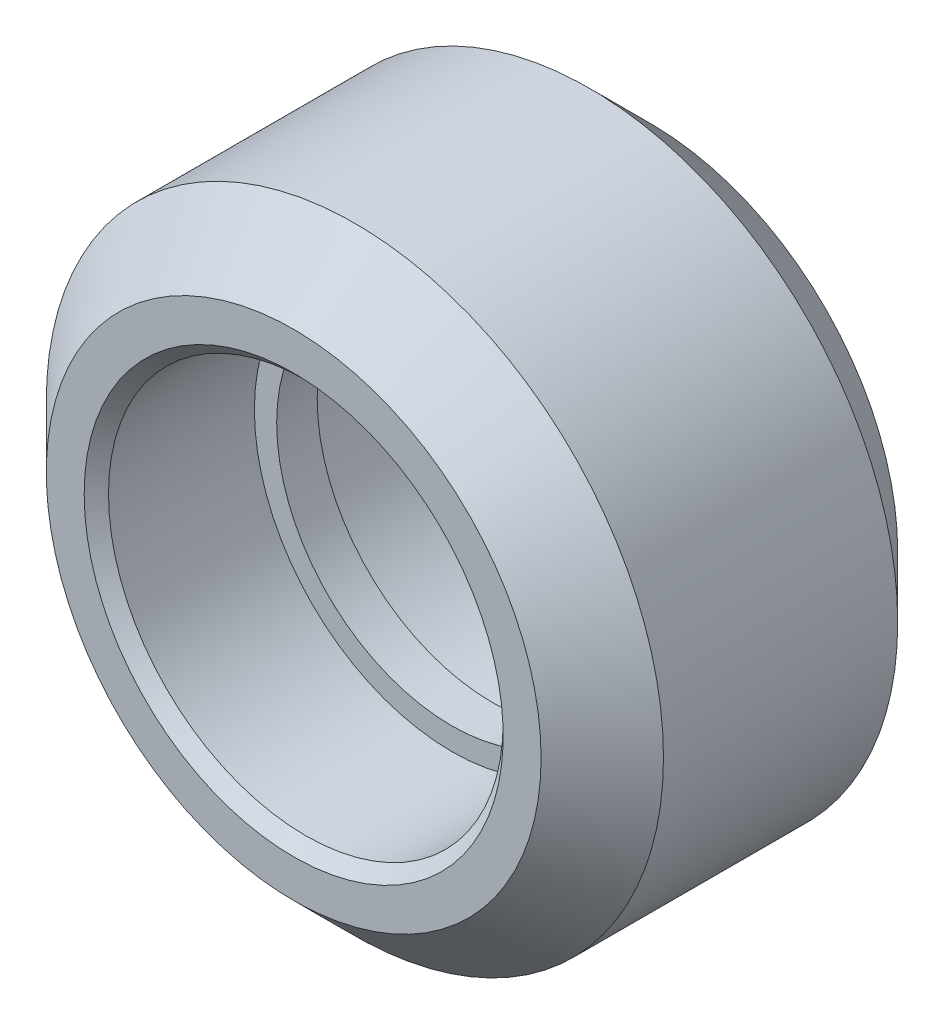
ISO-10303-21;
HEADER;
FILE_DESCRIPTION(('STEP AP214'),'2;1');
FILE_NAME('part.step','',(''),(''),'','','');
FILE_SCHEMA(('AUTOMOTIVE_DESIGN { 1 0 10303 214 1 1 1 1 }'));
ENDSEC;
DATA;
#1=APPLICATION_CONTEXT('core data for automotive mechanical design processes');
#2=APPLICATION_PROTOCOL_DEFINITION('international standard','automotive_design',2000,#1);
#3=PRODUCT_CONTEXT('',#1,'mechanical');
#4=PRODUCT('Part','Part','',(#3));
#5=PRODUCT_RELATED_PRODUCT_CATEGORY('part','',(#4));
#6=PRODUCT_DEFINITION_FORMATION('','',#4);
#7=PRODUCT_DEFINITION_CONTEXT('part definition',#1,'design');
#8=PRODUCT_DEFINITION('design','',#6,#7);
#9=PRODUCT_DEFINITION_SHAPE('','',#8);
#10=(LENGTH_UNIT() NAMED_UNIT(*) SI_UNIT(.MILLI.,.METRE.));
#11=(NAMED_UNIT(*) PLANE_ANGLE_UNIT() SI_UNIT($,.RADIAN.));
#12=(NAMED_UNIT(*) SI_UNIT($,.STERADIAN.) SOLID_ANGLE_UNIT());
#13=UNCERTAINTY_MEASURE_WITH_UNIT(LENGTH_MEASURE(1.E-05),#10,'distance_accuracy_value','');
#14=(GEOMETRIC_REPRESENTATION_CONTEXT(3) GLOBAL_UNCERTAINTY_ASSIGNED_CONTEXT((#13)) GLOBAL_UNIT_ASSIGNED_CONTEXT((#10,
#11,#12)) REPRESENTATION_CONTEXT('',''));
#15=CARTESIAN_POINT('',(0.,0.,0.));
#16=DIRECTION('',(0.,0.,1.));
#17=DIRECTION('',(1.,0.,0.));
#18=AXIS2_PLACEMENT_3D('',#15,#16,#17);
#19=CARTESIAN_POINT('',(0.,0.,0.));
#20=DIRECTION('',(0.,0.,1.));
#21=DIRECTION('',(1.,0.,0.));
#22=AXIS2_PLACEMENT_3D('',#19,#20,#21);
#23=CYLINDRICAL_SURFACE('',#22,7.615);
#24=CARTESIAN_POINT('',(0.,0.,2.89));
#25=DIRECTION('',(0.,0.,1.));
#26=DIRECTION('',(1.,0.,0.));
#27=AXIS2_PLACEMENT_3D('',#24,#25,#26);
#28=CIRCLE('',#27,7.615);
#29=CARTESIAN_POINT('',(7.615,0.,2.89));
#30=VERTEX_POINT('',#29);
#31=EDGE_CURVE('E50',#30,#30,#28,.T.);
#32=ORIENTED_EDGE('',*,*,#31,.F.);
#33=EDGE_LOOP('',(#32));
#34=FACE_BOUND('',#33,.T.);
#35=CARTESIAN_POINT('',(0.,0.,-2.89));
#36=DIRECTION('',(0.,0.,1.));
#37=DIRECTION('',(1.,0.,0.));
#38=AXIS2_PLACEMENT_3D('',#35,#36,#37);
#39=CIRCLE('',#38,7.615);
#40=CARTESIAN_POINT('',(7.615,0.,-2.89));
#41=VERTEX_POINT('',#40);
#42=EDGE_CURVE('E71',#41,#41,#39,.T.);
#43=ORIENTED_EDGE('',*,*,#42,.T.);
#44=EDGE_LOOP('',(#43));
#45=FACE_BOUND('',#44,.T.);
#46=ADVANCED_FACE('F30',(#34,#45),#23,.T.);
#47=CARTESIAN_POINT('',(0.,0.,2.89));
#48=DIRECTION('',(0.,0.,-1.));
#49=DIRECTION('',(-1.,0.,0.));
#50=AXIS2_PLACEMENT_3D('',#47,#48,#49);
#51=CONICAL_SURFACE('',#50,7.615,0.785398163397449);
#52=CARTESIAN_POINT('',(0.,0.,4.4));
#53=DIRECTION('',(0.,0.,1.));
#54=DIRECTION('',(1.,0.,0.));
#55=AXIS2_PLACEMENT_3D('',#52,#53,#54);
#56=CIRCLE('',#55,6.105);
#57=CARTESIAN_POINT('',(6.105,0.,4.4));
#58=VERTEX_POINT('',#57);
#59=EDGE_CURVE('E53',#58,#58,#56,.T.);
#60=ORIENTED_EDGE('',*,*,#59,.F.);
#61=EDGE_LOOP('',(#60));
#62=FACE_BOUND('',#61,.T.);
#63=ORIENTED_EDGE('',*,*,#31,.T.);
#64=EDGE_LOOP('',(#63));
#65=FACE_BOUND('',#64,.T.);
#66=ADVANCED_FACE('F95',(#62,#65),#51,.T.);
#67=CARTESIAN_POINT('',(0.,4.87,4.4));
#68=DIRECTION('',(0.,0.,-1.));
#69=DIRECTION('',(-1.,0.,0.));
#70=AXIS2_PLACEMENT_3D('',#67,#68,#69);
#71=PLANE('',#70);
#72=CARTESIAN_POINT('',(0.,0.,4.4));
#73=DIRECTION('',(0.,0.,-1.));
#74=DIRECTION('',(-1.,0.,0.));
#75=AXIS2_PLACEMENT_3D('',#72,#73,#74);
#76=CIRCLE('',#75,5.17);
#77=CARTESIAN_POINT('',(-5.17,0.,4.4));
#78=VERTEX_POINT('',#77);
#79=EDGE_CURVE('E10',#78,#78,#76,.T.);
#80=ORIENTED_EDGE('',*,*,#79,.T.);
#81=EDGE_LOOP('',(#80));
#82=FACE_BOUND('',#81,.T.);
#83=ORIENTED_EDGE('',*,*,#59,.T.);
#84=EDGE_LOOP('',(#83));
#85=FACE_BOUND('',#84,.T.);
#86=ADVANCED_FACE('F101',(#82,#85),#71,.F.);
#87=CARTESIAN_POINT('',(0.,0.,0.));
#88=DIRECTION('',(0.,0.,1.));
#89=DIRECTION('',(1.,0.,0.));
#90=AXIS2_PLACEMENT_3D('',#87,#88,#89);
#91=CYLINDRICAL_SURFACE('',#90,4.87);
#92=CARTESIAN_POINT('',(0.,0.,4.1));
#93=DIRECTION('',(0.,0.,-1.));
#94=DIRECTION('',(-1.,0.,0.));
#95=AXIS2_PLACEMENT_3D('',#92,#93,#94);
#96=CIRCLE('',#95,4.87);
#97=CARTESIAN_POINT('',(-4.87,0.,4.1));
#98=VERTEX_POINT('',#97);
#99=EDGE_CURVE('E37',#98,#98,#96,.F.);
#100=ORIENTED_EDGE('',*,*,#99,.T.);
#101=EDGE_LOOP('',(#100));
#102=FACE_BOUND('',#101,.T.);
#103=CARTESIAN_POINT('',(0.,0.,0.5));
#104=DIRECTION('',(0.,0.,1.));
#105=DIRECTION('',(1.,0.,0.));
#106=AXIS2_PLACEMENT_3D('',#103,#104,#105);
#107=CIRCLE('',#106,4.87);
#108=CARTESIAN_POINT('',(4.87,0.,0.5));
#109=VERTEX_POINT('',#108);
#110=EDGE_CURVE('E56',#109,#109,#107,.T.);
#111=ORIENTED_EDGE('',*,*,#110,.F.);
#112=EDGE_LOOP('',(#111));
#113=FACE_BOUND('',#112,.T.);
#114=ADVANCED_FACE('F132',(#102,#113),#91,.F.);
#115=CARTESIAN_POINT('',(0.,4.32,0.5));
#116=DIRECTION('',(0.,0.,-1.));
#117=DIRECTION('',(-1.,0.,0.));
#118=AXIS2_PLACEMENT_3D('',#115,#116,#117);
#119=PLANE('',#118);
#120=CARTESIAN_POINT('',(0.,0.,0.5));
#121=DIRECTION('',(0.,0.,1.));
#122=DIRECTION('',(1.,0.,0.));
#123=AXIS2_PLACEMENT_3D('',#120,#121,#122);
#124=CIRCLE('',#123,4.32);
#125=CARTESIAN_POINT('',(4.32,0.,0.5));
#126=VERTEX_POINT('',#125);
#127=EDGE_CURVE('E59',#126,#126,#124,.T.);
#128=ORIENTED_EDGE('',*,*,#127,.F.);
#129=EDGE_LOOP('',(#128));
#130=FACE_BOUND('',#129,.T.);
#131=ORIENTED_EDGE('',*,*,#110,.T.);
#132=EDGE_LOOP('',(#131));
#133=FACE_BOUND('',#132,.T.);
#134=ADVANCED_FACE('F126',(#130,#133),#119,.F.);
#135=CARTESIAN_POINT('',(0.,0.,0.));
#136=DIRECTION('',(0.,0.,1.));
#137=DIRECTION('',(1.,0.,0.));
#138=AXIS2_PLACEMENT_3D('',#135,#136,#137);
#139=CYLINDRICAL_SURFACE('',#138,4.32);
#140=CARTESIAN_POINT('',(0.,0.,-0.5));
#141=DIRECTION('',(0.,0.,1.));
#142=DIRECTION('',(1.,0.,0.));
#143=AXIS2_PLACEMENT_3D('',#140,#141,#142);
#144=CIRCLE('',#143,4.32);
#145=CARTESIAN_POINT('',(4.32,0.,-0.5));
#146=VERTEX_POINT('',#145);
#147=EDGE_CURVE('E62',#146,#146,#144,.T.);
#148=ORIENTED_EDGE('',*,*,#147,.F.);
#149=EDGE_LOOP('',(#148));
#150=FACE_BOUND('',#149,.T.);
#151=ORIENTED_EDGE('',*,*,#127,.T.);
#152=EDGE_LOOP('',(#151));
#153=FACE_BOUND('',#152,.T.);
#154=ADVANCED_FACE('F120',(#150,#153),#139,.F.);
#155=CARTESIAN_POINT('',(0.,4.32,-0.5));
#156=DIRECTION('',(0.,0.,1.));
#157=DIRECTION('',(1.,0.,0.));
#158=AXIS2_PLACEMENT_3D('',#155,#156,#157);
#159=PLANE('',#158);
#160=CARTESIAN_POINT('',(0.,0.,-0.5));
#161=DIRECTION('',(0.,0.,1.));
#162=DIRECTION('',(1.,0.,0.));
#163=AXIS2_PLACEMENT_3D('',#160,#161,#162);
#164=CIRCLE('',#163,4.87);
#165=CARTESIAN_POINT('',(4.87,0.,-0.5));
#166=VERTEX_POINT('',#165);
#167=EDGE_CURVE('E65',#166,#166,#164,.T.);
#168=ORIENTED_EDGE('',*,*,#167,.F.);
#169=EDGE_LOOP('',(#168));
#170=FACE_BOUND('',#169,.T.);
#171=ORIENTED_EDGE('',*,*,#147,.T.);
#172=EDGE_LOOP('',(#171));
#173=FACE_BOUND('',#172,.T.);
#174=ADVANCED_FACE('F91',(#170,#173),#159,.F.);
#175=CARTESIAN_POINT('',(0.,0.,0.));
#176=DIRECTION('',(0.,0.,1.));
#177=DIRECTION('',(1.,0.,0.));
#178=AXIS2_PLACEMENT_3D('',#175,#176,#177);
#179=CYLINDRICAL_SURFACE('',#178,4.87);
#180=CARTESIAN_POINT('',(0.,0.,-4.1));
#181=DIRECTION('',(0.,0.,1.));
#182=DIRECTION('',(1.,0.,0.));
#183=AXIS2_PLACEMENT_3D('',#180,#181,#182);
#184=CIRCLE('',#183,4.87);
#185=CARTESIAN_POINT('',(4.87,0.,-4.1));
#186=VERTEX_POINT('',#185);
#187=EDGE_CURVE('E41',#186,#186,#184,.F.);
#188=ORIENTED_EDGE('',*,*,#187,.T.);
#189=EDGE_LOOP('',(#188));
#190=FACE_BOUND('',#189,.T.);
#191=ORIENTED_EDGE('',*,*,#167,.T.);
#192=EDGE_LOOP('',(#191));
#193=FACE_BOUND('',#192,.T.);
#194=ADVANCED_FACE('F85',(#190,#193),#179,.F.);
#195=CARTESIAN_POINT('',(0.,4.87,-4.4));
#196=DIRECTION('',(0.,0.,1.));
#197=DIRECTION('',(1.,0.,0.));
#198=AXIS2_PLACEMENT_3D('',#195,#196,#197);
#199=PLANE('',#198);
#200=CARTESIAN_POINT('',(0.,0.,-4.4));
#201=DIRECTION('',(0.,0.,1.));
#202=DIRECTION('',(1.,0.,0.));
#203=AXIS2_PLACEMENT_3D('',#200,#201,#202);
#204=CIRCLE('',#203,5.17);
#205=CARTESIAN_POINT('',(5.17,0.,-4.4));
#206=VERTEX_POINT('',#205);
#207=EDGE_CURVE('E45',#206,#206,#204,.T.);
#208=ORIENTED_EDGE('',*,*,#207,.T.);
#209=EDGE_LOOP('',(#208));
#210=FACE_BOUND('',#209,.T.);
#211=CARTESIAN_POINT('',(0.,0.,-4.4));
#212=DIRECTION('',(0.,0.,1.));
#213=DIRECTION('',(1.,0.,0.));
#214=AXIS2_PLACEMENT_3D('',#211,#212,#213);
#215=CIRCLE('',#214,6.105);
#216=CARTESIAN_POINT('',(6.105,0.,-4.4));
#217=VERTEX_POINT('',#216);
#218=EDGE_CURVE('E68',#217,#217,#215,.T.);
#219=ORIENTED_EDGE('',*,*,#218,.F.);
#220=EDGE_LOOP('',(#219));
#221=FACE_BOUND('',#220,.T.);
#222=ADVANCED_FACE('F80',(#210,#221),#199,.F.);
#223=CARTESIAN_POINT('',(0.,0.,-4.4));
#224=DIRECTION('',(0.,0.,1.));
#225=DIRECTION('',(1.,0.,0.));
#226=AXIS2_PLACEMENT_3D('',#223,#224,#225);
#227=CONICAL_SURFACE('',#226,6.105,0.785398163397448);
#228=ORIENTED_EDGE('',*,*,#42,.F.);
#229=EDGE_LOOP('',(#228));
#230=FACE_BOUND('',#229,.T.);
#231=ORIENTED_EDGE('',*,*,#218,.T.);
#232=EDGE_LOOP('',(#231));
#233=FACE_BOUND('',#232,.T.);
#234=ADVANCED_FACE('F76',(#230,#233),#227,.T.);
#235=CARTESIAN_POINT('',(0.,0.,-4.4));
#236=DIRECTION('',(0.,0.,-1.));
#237=DIRECTION('',(-1.,0.,0.));
#238=AXIS2_PLACEMENT_3D('',#235,#236,#237);
#239=CONICAL_SURFACE('',#238,5.17,0.785398163397451);
#240=ORIENTED_EDGE('',*,*,#187,.F.);
#241=EDGE_LOOP('',(#240));
#242=FACE_BOUND('',#241,.T.);
#243=ORIENTED_EDGE('',*,*,#207,.F.);
#244=EDGE_LOOP('',(#243));
#245=FACE_BOUND('',#244,.T.);
#246=ADVANCED_FACE('F79',(#242,#245),#239,.F.);
#247=CARTESIAN_POINT('',(0.,0.,4.1));
#248=DIRECTION('',(0.,0.,1.));
#249=DIRECTION('',(1.,0.,0.));
#250=AXIS2_PLACEMENT_3D('',#247,#248,#249);
#251=CONICAL_SURFACE('',#250,4.87,0.785398163397448);
#252=ORIENTED_EDGE('',*,*,#79,.F.);
#253=EDGE_LOOP('',(#252));
#254=FACE_BOUND('',#253,.T.);
#255=ORIENTED_EDGE('',*,*,#99,.F.);
#256=EDGE_LOOP('',(#255));
#257=FACE_BOUND('',#256,.T.);
#258=ADVANCED_FACE('F32',(#254,#257),#251,.F.);
#259=CLOSED_SHELL('',(#46,#66,#86,#114,#134,#154,#174,#194,#222,#234,#246,#258));
#260=MANIFOLD_SOLID_BREP('B2',#259);
#261=ADVANCED_BREP_SHAPE_REPRESENTATION('',(#18,#260),#14);
#262=SHAPE_DEFINITION_REPRESENTATION(#9,#261);
ENDSEC;
END-ISO-10303-21;
